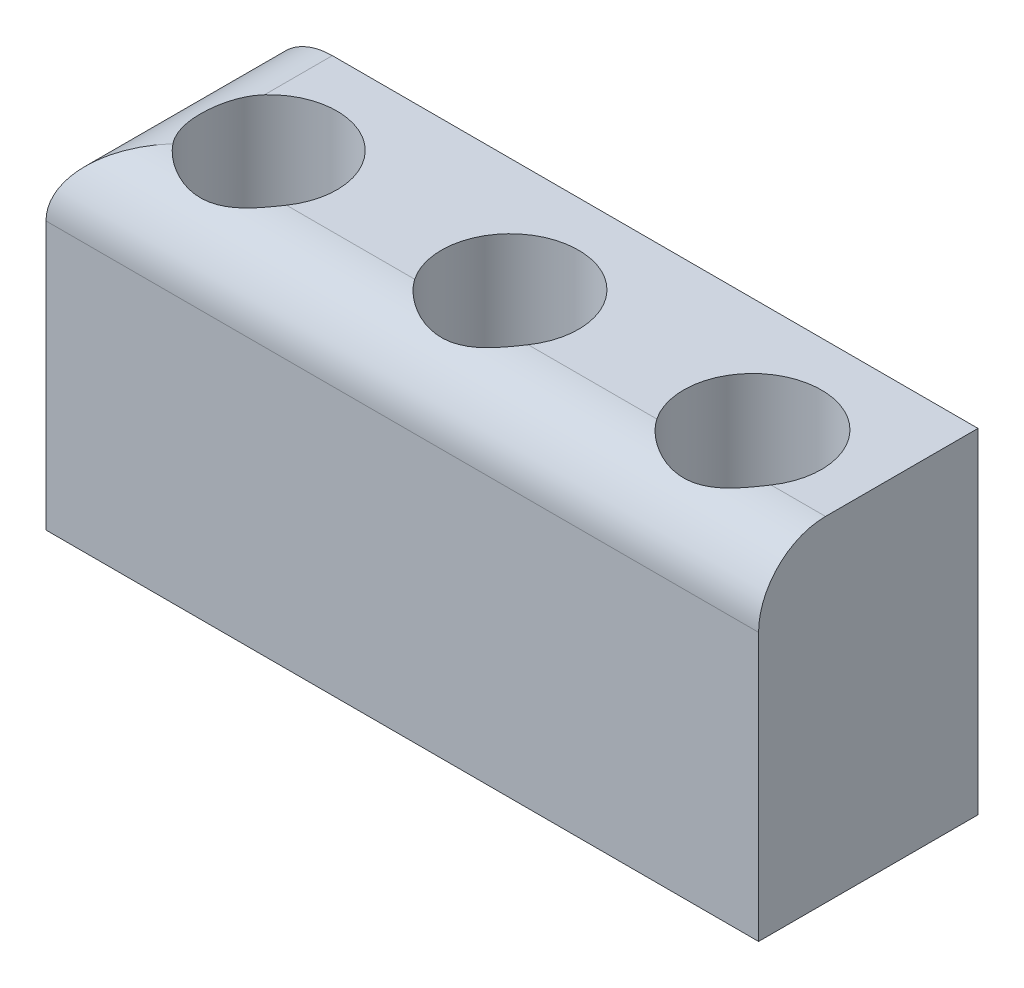
ISO-10303-21;
HEADER;
FILE_DESCRIPTION(('STEP AP214'),'2;1');
FILE_NAME('part.step','',(''),(''),'','','');
FILE_SCHEMA(('AUTOMOTIVE_DESIGN { 1 0 10303 214 1 1 1 1 }'));
ENDSEC;
DATA;
#1=APPLICATION_CONTEXT('core data for automotive mechanical design processes');
#2=APPLICATION_PROTOCOL_DEFINITION('international standard','automotive_design',2000,#1);
#3=PRODUCT_CONTEXT('',#1,'mechanical');
#4=PRODUCT('Part','Part','',(#3));
#5=PRODUCT_RELATED_PRODUCT_CATEGORY('part','',(#4));
#6=PRODUCT_DEFINITION_FORMATION('','',#4);
#7=PRODUCT_DEFINITION_CONTEXT('part definition',#1,'design');
#8=PRODUCT_DEFINITION('design','',#6,#7);
#9=PRODUCT_DEFINITION_SHAPE('','',#8);
#10=(LENGTH_UNIT() NAMED_UNIT(*) SI_UNIT(.MILLI.,.METRE.));
#11=(NAMED_UNIT(*) PLANE_ANGLE_UNIT() SI_UNIT($,.RADIAN.));
#12=(NAMED_UNIT(*) SI_UNIT($,.STERADIAN.) SOLID_ANGLE_UNIT());
#13=UNCERTAINTY_MEASURE_WITH_UNIT(LENGTH_MEASURE(1.E-05),#10,'distance_accuracy_value','');
#14=(GEOMETRIC_REPRESENTATION_CONTEXT(3) GLOBAL_UNCERTAINTY_ASSIGNED_CONTEXT((#13)) GLOBAL_UNIT_ASSIGNED_CONTEXT((#10,
#11,#12)) REPRESENTATION_CONTEXT('',''));
#15=CARTESIAN_POINT('',(0.,0.,0.));
#16=DIRECTION('',(0.,0.,1.));
#17=DIRECTION('',(1.,0.,0.));
#18=AXIS2_PLACEMENT_3D('',#15,#16,#17);
#19=CARTESIAN_POINT('',(0.,10.,0.));
#20=DIRECTION('',(0.,0.,-1.));
#21=DIRECTION('',(-1.,0.,0.));
#22=AXIS2_PLACEMENT_3D('',#19,#20,#21);
#23=PLANE('',#22);
#24=DIRECTION('',(0.,-1.,0.));
#25=VECTOR('',#24,1.);
#26=CARTESIAN_POINT('',(21.2931862765664,10.,0.));
#27=LINE('',#26,#25);
#28=CARTESIAN_POINT('',(21.2931862765664,8.,0.));
#29=VERTEX_POINT('',#28);
#30=CARTESIAN_POINT('',(21.2931862765664,0.,0.));
#31=VERTEX_POINT('',#30);
#32=EDGE_CURVE('E141',#29,#31,#27,.T.);
#33=ORIENTED_EDGE('',*,*,#32,.F.);
#34=DIRECTION('',(1.,0.,0.));
#35=VECTOR('',#34,1.);
#36=CARTESIAN_POINT('',(0.,8.,0.));
#37=LINE('',#36,#35);
#38=CARTESIAN_POINT('',(0.,8.,0.));
#39=VERTEX_POINT('',#38);
#40=EDGE_CURVE('E337',#29,#39,#37,.F.);
#41=ORIENTED_EDGE('',*,*,#40,.T.);
#42=DIRECTION('',(0.,-1.,0.));
#43=VECTOR('',#42,1.);
#44=CARTESIAN_POINT('',(0.,10.,0.));
#45=LINE('',#44,#43);
#46=CARTESIAN_POINT('',(0.,0.,0.));
#47=VERTEX_POINT('',#46);
#48=EDGE_CURVE('E122',#39,#47,#45,.T.);
#49=ORIENTED_EDGE('',*,*,#48,.T.);
#50=DIRECTION('',(1.,0.,0.));
#51=VECTOR('',#50,1.);
#52=CARTESIAN_POINT('',(0.,0.,0.));
#53=LINE('',#52,#51);
#54=EDGE_CURVE('E323',#47,#31,#53,.T.);
#55=ORIENTED_EDGE('',*,*,#54,.T.);
#56=EDGE_LOOP('',(#33,#41,#49,#55));
#57=FACE_BOUND('',#56,.T.);
#58=ADVANCED_FACE('F41',(#57),#23,.F.);
#59=CARTESIAN_POINT('',(21.2931862765664,10.,0.));
#60=DIRECTION('',(-1.,0.,0.));
#61=DIRECTION('',(0.,0.,1.));
#62=AXIS2_PLACEMENT_3D('',#59,#60,#61);
#63=PLANE('',#62);
#64=DIRECTION('',(0.,0.,-1.));
#65=VECTOR('',#64,1.);
#66=CARTESIAN_POINT('',(21.2931862765664,10.,0.));
#67=LINE('',#66,#65);
#68=CARTESIAN_POINT('',(21.2931862765664,10.,-2.));
#69=VERTEX_POINT('',#68);
#70=CARTESIAN_POINT('',(21.2931862765664,10.,-6.55624890817712));
#71=VERTEX_POINT('',#70);
#72=EDGE_CURVE('E123',#69,#71,#67,.T.);
#73=ORIENTED_EDGE('',*,*,#72,.F.);
#74=CARTESIAN_POINT('',(21.2931862765664,8.,-2.));
#75=DIRECTION('',(-1.,0.,0.));
#76=DIRECTION('',(0.,0.,1.));
#77=AXIS2_PLACEMENT_3D('',#74,#75,#76);
#78=CIRCLE('',#77,2.);
#79=EDGE_CURVE('E341',#69,#29,#78,.F.);
#80=ORIENTED_EDGE('',*,*,#79,.T.);
#81=ORIENTED_EDGE('',*,*,#32,.T.);
#82=DIRECTION('',(0.,0.,-1.));
#83=VECTOR('',#82,1.);
#84=CARTESIAN_POINT('',(21.2931862765664,0.,0.));
#85=LINE('',#84,#83);
#86=CARTESIAN_POINT('',(21.2931862765664,0.,-6.55624890817712));
#87=VERTEX_POINT('',#86);
#88=EDGE_CURVE('E138',#31,#87,#85,.T.);
#89=ORIENTED_EDGE('',*,*,#88,.T.);
#90=DIRECTION('',(0.,-1.,0.));
#91=VECTOR('',#90,1.);
#92=CARTESIAN_POINT('',(21.2931862765664,10.,-6.55624890817712));
#93=LINE('',#92,#91);
#94=EDGE_CURVE('E116',#71,#87,#93,.T.);
#95=ORIENTED_EDGE('',*,*,#94,.F.);
#96=EDGE_LOOP('',(#73,#80,#81,#89,#95));
#97=FACE_BOUND('',#96,.T.);
#98=ADVANCED_FACE('F136',(#97),#63,.F.);
#99=CARTESIAN_POINT('',(0.,10.,-6.55624890817712));
#100=DIRECTION('',(0.,0.,-1.));
#101=DIRECTION('',(-1.,0.,0.));
#102=AXIS2_PLACEMENT_3D('',#99,#100,#101);
#103=PLANE('',#102);
#104=DIRECTION('',(0.,-1.,0.));
#105=VECTOR('',#104,1.);
#106=CARTESIAN_POINT('',(0.,10.,-6.55624890817712));
#107=LINE('',#106,#105);
#108=CARTESIAN_POINT('',(0.,8.,-6.55624890817712));
#109=VERTEX_POINT('',#108);
#110=CARTESIAN_POINT('',(0.,0.,-6.55624890817712));
#111=VERTEX_POINT('',#110);
#112=EDGE_CURVE('E142',#109,#111,#107,.T.);
#113=ORIENTED_EDGE('',*,*,#112,.F.);
#114=CARTESIAN_POINT('',(2.,8.,-6.55624890817712));
#115=DIRECTION('',(0.,0.,-1.));
#116=DIRECTION('',(-1.,0.,0.));
#117=AXIS2_PLACEMENT_3D('',#114,#115,#116);
#118=CIRCLE('',#117,2.);
#119=CARTESIAN_POINT('',(2.,10.,-6.55624890817712));
#120=VERTEX_POINT('',#119);
#121=EDGE_CURVE('E11',#109,#120,#118,.T.);
#122=ORIENTED_EDGE('',*,*,#121,.T.);
#123=DIRECTION('',(1.,0.,0.));
#124=VECTOR('',#123,1.);
#125=CARTESIAN_POINT('',(0.,10.,-6.55624890817712));
#126=LINE('',#125,#124);
#127=EDGE_CURVE('E111',#120,#71,#126,.T.);
#128=ORIENTED_EDGE('',*,*,#127,.T.);
#129=ORIENTED_EDGE('',*,*,#94,.T.);
#130=DIRECTION('',(1.,0.,0.));
#131=VECTOR('',#130,1.);
#132=CARTESIAN_POINT('',(0.,0.,-6.55624890817712));
#133=LINE('',#132,#131);
#134=EDGE_CURVE('E329',#111,#87,#133,.T.);
#135=ORIENTED_EDGE('',*,*,#134,.F.);
#136=EDGE_LOOP('',(#113,#122,#128,#129,#135));
#137=FACE_BOUND('',#136,.T.);
#138=ADVANCED_FACE('F113',(#137),#103,.T.);
#139=CARTESIAN_POINT('',(10.7125456911819,10.,-3.15215181068118));
#140=DIRECTION('',(0.,-1.,0.));
#141=DIRECTION('',(0.,0.,-1.));
#142=AXIS2_PLACEMENT_3D('',#139,#140,#141);
#143=CYLINDRICAL_SURFACE('',#142,2.05);
#144=CARTESIAN_POINT('',(10.7125456911819,10.,-3.15215181068118));
#145=DIRECTION('',(0.,1.,0.));
#146=DIRECTION('',(0.,0.,1.));
#147=AXIS2_PLACEMENT_3D('',#144,#145,#146);
#148=CIRCLE('',#147,2.05);
#149=CARTESIAN_POINT('',(12.4081418120621,10.,-2.));
#150=VERTEX_POINT('',#149);
#151=CARTESIAN_POINT('',(9.01694957030164,10.,-2.));
#152=VERTEX_POINT('',#151);
#153=EDGE_CURVE('E134',#150,#152,#148,.T.);
#154=ORIENTED_EDGE('',*,*,#153,.T.);
#155=CARTESIAN_POINT('',(9.01694957030164,10.,-2.));
#156=CARTESIAN_POINT('',(9.04811516550061,10.0000017409659,-1.95412551525751));
#157=CARTESIAN_POINT('',(9.08112011219997,9.99842181852425,-1.90956707539432));
#158=CARTESIAN_POINT('',(9.15049452015726,9.99265575706904,-1.82341271174332));
#159=CARTESIAN_POINT('',(9.18685992637992,9.98847272512037,-1.78181332190696));
#160=CARTESIAN_POINT('',(9.30028207105843,9.97289585578887,-1.66217142989845));
#161=CARTESIAN_POINT('',(9.38196796385999,9.95846357422247,-1.58884164983283));
#162=CARTESIAN_POINT('',(9.55505906481159,9.92599358200038,-1.4566990536128));
#163=CARTESIAN_POINT('',(9.64642643333023,9.9079696821687,-1.39783250098881));
#164=CARTESIAN_POINT('',(9.8375020040176,9.87245570894824,-1.29511591080512));
#165=CARTESIAN_POINT('',(9.93722116516283,9.8549663793918,-1.25128600047153));
#166=CARTESIAN_POINT('',(10.1506493519562,9.82340055121845,-1.1772083491275));
#167=CARTESIAN_POINT('',(10.2648482049664,9.80966669475506,-1.14818669701453));
#168=CARTESIAN_POINT('',(10.4389474382913,9.79584449522583,-1.1196374604616));
#169=CARTESIAN_POINT('',(10.4974362299492,9.79236687643152,-1.11261816860742));
#170=CARTESIAN_POINT('',(10.6148919150787,9.78788972889715,-1.10363222934585));
#171=CARTESIAN_POINT('',(10.6738587529039,9.78688991577071,-1.10166500209453));
#172=CARTESIAN_POINT('',(10.8398001359856,9.78773491380615,-1.10331725019623));
#173=CARTESIAN_POINT('',(10.9467674658554,9.79255905341332,-1.11279039631568));
#174=CARTESIAN_POINT('',(11.1573432589018,9.80960815253039,-1.1481318671608));
#175=CARTESIAN_POINT('',(11.260948364144,9.82184028461422,-1.17401608256897));
#176=CARTESIAN_POINT('',(11.4618049531749,9.85076414261979,-1.24106219308133));
#177=CARTESIAN_POINT('',(11.5590855121883,9.86743335327071,-1.28214735278207));
#178=CARTESIAN_POINT('',(11.7459865726393,9.90169648998168,-1.37857663601589));
#179=CARTESIAN_POINT('',(11.835612043127,9.91928980402491,-1.43391141474995));
#180=CARTESIAN_POINT('',(12.0147188868153,9.95331176583779,-1.56459000462227));
#181=CARTESIAN_POINT('',(12.1031945219278,9.96942352022737,-1.64142579666401));
#182=CARTESIAN_POINT('',(12.2256551895564,9.98693187083065,-1.76778473953623));
#183=CARTESIAN_POINT('',(12.2648554671586,9.99166167242333,-1.81188510034));
#184=CARTESIAN_POINT('',(12.3394528108292,9.99819866141854,-1.9034843877563));
#185=CARTESIAN_POINT('',(12.37484480588,10.0000019958956,-1.95098770891097));
#186=CARTESIAN_POINT('',(12.4081418120621,10.,-2.));
#187=B_SPLINE_CURVE_WITH_KNOTS('',3,(#155,#156,#157,#158,#159,#160,#161,#162,#163,#164,#165,
#166,#167,#168,#169,#170,#171,#172,#173,#174,#175,#176,#177,#178,#179,#180,#181,#182,#183,#184,
#185,#186),.UNSPECIFIED.,.F.,.F.,(4,2,2,2,2,2,2,2,2,2,2,2,2,2,2,4),(0.,0.166218724754862,
0.332239430796913,0.66269233706878,0.991898258682401,1.32154313355269,1.67526892557877,
1.85206622728029,2.02884323640177,2.34956938109803,2.67060655715533,2.99004474862322,
3.30927398591472,3.66206412979007,3.83938792292995,4.01694498801978),.UNSPECIFIED.);
#188=EDGE_CURVE('E162',#152,#150,#187,.T.);
#189=ORIENTED_EDGE('',*,*,#188,.T.);
#190=EDGE_LOOP('',(#154,#189));
#191=FACE_BOUND('',#190,.T.);
#192=CARTESIAN_POINT('',(10.7125456911819,0.,-3.15215181068118));
#193=DIRECTION('',(0.,1.,0.));
#194=DIRECTION('',(0.,0.,1.));
#195=AXIS2_PLACEMENT_3D('',#192,#193,#194);
#196=CIRCLE('',#195,2.05);
#197=CARTESIAN_POINT('',(10.7125456911819,0.,-1.10215181068118));
#198=VERTEX_POINT('',#197);
#199=EDGE_CURVE('E319',#198,#198,#196,.T.);
#200=ORIENTED_EDGE('',*,*,#199,.F.);
#201=EDGE_LOOP('',(#200));
#202=FACE_BOUND('',#201,.T.);
#203=ADVANCED_FACE('F177',(#191,#202),#143,.F.);
#204=CARTESIAN_POINT('',(3.50247739127908,10.,-3.15215181068118));
#205=DIRECTION('',(0.,-1.,0.));
#206=DIRECTION('',(0.,0.,-1.));
#207=AXIS2_PLACEMENT_3D('',#204,#205,#206);
#208=CYLINDRICAL_SURFACE('',#207,2.04);
#209=CARTESIAN_POINT('',(2.,10.,-4.53206546330414));
#210=CARTESIAN_POINT('',(1.96152282678187,9.9999968813164,-4.49017276144605));
#211=CARTESIAN_POINT('',(1.92483190303057,9.9988903583751,-4.44670248400531));
#212=CARTESIAN_POINT('',(1.85525093852736,9.9950596218343,-4.3569212378015));
#213=CARTESIAN_POINT('',(1.8223588141054,9.9923363001434,-4.31061184785865));
#214=CARTESIAN_POINT('',(1.7297049349696,9.9826260223704,-4.16789019112435));
#215=CARTESIAN_POINT('',(1.67591170612522,9.97409711626893,-4.06762549476744));
#216=CARTESIAN_POINT('',(1.58575448050229,9.95717025706446,-3.85969706323972));
#217=CARTESIAN_POINT('',(1.5493763400317,9.94877220307134,-3.75203941380689));
#218=CARTESIAN_POINT('',(1.49496746917773,9.93539067008869,-3.53204008034623));
#219=CARTESIAN_POINT('',(1.47691939552641,9.93040396486169,-3.41970292888682));
#220=CARTESIAN_POINT('',(1.45973713631012,9.92566925519223,-3.19338759381071));
#221=CARTESIAN_POINT('',(1.46061687116165,9.92592510637013,-3.07940826402465));
#222=CARTESIAN_POINT('',(1.48130321971913,9.93159571571192,-2.85321120935946));
#223=CARTESIAN_POINT('',(1.50112833595601,9.93701551710276,-2.74099531560322));
#224=CARTESIAN_POINT('',(1.55847287105539,9.95086964404149,-2.52379431121379));
#225=CARTESIAN_POINT('',(1.59563753057686,9.95924274432075,-2.41871053476813));
#226=CARTESIAN_POINT('',(1.68650624771414,9.97581538357308,-2.21613856881463));
#227=CARTESIAN_POINT('',(1.74017551717264,9.98401524919998,-2.11863493848165));
#228=CARTESIAN_POINT('',(1.83103072746683,9.99306721348111,-1.98135354310488));
#229=CARTESIAN_POINT('',(1.86241595879251,9.99552702713277,-1.93776818496805));
#230=CARTESIAN_POINT('',(1.8954912889424,9.99726761584748,-1.8954912889424));
#231=B_SPLINE_CURVE_WITH_KNOTS('',3,(#209,#210,#211,#212,#213,#214,#215,#216,#217,#218,#219,
#220,#221,#222,#223,#224,#225,#226,#227,#228,#229,#230),.UNSPECIFIED.,.F.,.F.,(4,2,2,2,2,2,2,2,
2,2,4),(0.,0.170503303976342,0.340912636922252,0.681494695044775,1.02179967765991,
1.36178237479678,1.70201512002638,2.04258048496618,2.37646459247655,2.70964971272202,
2.87077143140057),.UNSPECIFIED.);
#232=CARTESIAN_POINT('',(2.,10.,-4.53206546330414));
#233=VERTEX_POINT('',#232);
#234=CARTESIAN_POINT('',(1.8954912889424,9.99726761584748,-1.8954912889424));
#235=VERTEX_POINT('',#234);
#236=EDGE_CURVE('E66',#233,#235,#231,.T.);
#237=ORIENTED_EDGE('',*,*,#236,.T.);
#238=CARTESIAN_POINT('',(1.8954912889424,9.99726761584748,-1.8954912889424));
#239=CARTESIAN_POINT('',(1.9303328292988,9.9949362790777,-1.85093372265649));
#240=CARTESIAN_POINT('',(1.96696118614232,9.99119035534617,-1.80791729959754));
#241=CARTESIAN_POINT('',(2.04348030626066,9.98147266296752,-1.72523310354955));
#242=CARTESIAN_POINT('',(2.0833679204952,9.9755030234429,-1.6855621717963));
#243=CARTESIAN_POINT('',(2.2073908731636,9.95517776261309,-1.57199683223511));
#244=CARTESIAN_POINT('',(2.29602989506303,9.938391472129,-1.50336736697636));
#245=CARTESIAN_POINT('',(2.48270254818285,9.9031186382051,-1.38182321053908));
#246=CARTESIAN_POINT('',(2.58070971339243,9.88463689024258,-1.32886588404647));
#247=CARTESIAN_POINT('',(2.78455020902168,9.85036047701517,-1.23942371659152));
#248=CARTESIAN_POINT('',(2.89038379241026,9.83456589866067,-1.20293940834833));
#249=CARTESIAN_POINT('',(3.05474048838589,9.8155994969719,-1.16105167688425));
#250=CARTESIAN_POINT('',(3.11139826692209,9.81001685714625,-1.1491495876532));
#251=CARTESIAN_POINT('',(3.22567746593983,9.80098395220364,-1.13018973824175));
#252=CARTESIAN_POINT('',(3.28329843219951,9.79753270955836,-1.12312975714801));
#253=CARTESIAN_POINT('',(3.39898979792275,9.79302747974986,-1.11395290905562));
#254=CARTESIAN_POINT('',(3.45705987432083,9.79197190580231,-1.1118327701006));
#255=CARTESIAN_POINT('',(3.57314450079541,9.79232437686163,-1.11254898223543));
#256=CARTESIAN_POINT('',(3.63115905481972,9.79373223129868,-1.1153849499229));
#257=CARTESIAN_POINT('',(3.79279210665773,9.80101059975006,-1.13022870434017));
#258=CARTESIAN_POINT('',(3.89583986083324,9.80954667419995,-1.1477515035603));
#259=CARTESIAN_POINT('',(4.09747636534391,9.83239095820901,-1.19807491801104));
#260=CARTESIAN_POINT('',(4.19605984298853,9.84670580491441,-1.23089310731556));
#261=CARTESIAN_POINT('',(4.39101319420934,9.8787116682733,-1.31264955333048));
#262=CARTESIAN_POINT('',(4.48708805729437,9.89652482294332,-1.36224170663226));
#263=CARTESIAN_POINT('',(4.67024173163415,9.93104428796556,-1.4759860568529));
#264=CARTESIAN_POINT('',(4.7573337973505,9.9477522156681,-1.54011634172911));
#265=CARTESIAN_POINT('',(4.90444841241208,9.97304880179615,-1.66771454319505));
#266=CARTESIAN_POINT('',(4.96640431991322,9.98259241147199,-1.7287598519291));
#267=CARTESIAN_POINT('',(5.08244293133497,9.99607936798475,-1.85872229846082));
#268=CARTESIAN_POINT('',(5.13650527767468,10.0000084562277,-1.9276589998553));
#269=CARTESIAN_POINT('',(5.18596965593136,10.,-2.));
#270=B_SPLINE_CURVE_WITH_KNOTS('',3,(#238,#239,#240,#241,#242,#243,#244,#245,#246,#247,#248,
#249,#250,#251,#252,#253,#254,#255,#256,#257,#258,#259,#260,#261,#262,#263,#264,#265,#266,#267,
#268,#269),.UNSPECIFIED.,.F.,.F.,(4,2,2,2,2,2,2,2,2,2,2,2,2,2,2,4),(0.,0.169672227725612,
0.339182416632322,0.677514634480656,1.01491779104335,1.352331858069,1.52661240576198,
1.7008129632322,1.87489810429029,2.04896977878929,2.36202022833764,2.67543125621349,
3.00282569517661,3.32972992403501,3.59138595966477,3.85370532105994),.UNSPECIFIED.);
#271=CARTESIAN_POINT('',(5.18596965593136,10.,-2.));
#272=VERTEX_POINT('',#271);
#273=EDGE_CURVE('E190',#235,#272,#270,.T.);
#274=ORIENTED_EDGE('',*,*,#273,.T.);
#275=CARTESIAN_POINT('',(3.50247739127908,10.,-3.15215181068118));
#276=DIRECTION('',(0.,1.,0.));
#277=DIRECTION('',(0.,0.,1.));
#278=AXIS2_PLACEMENT_3D('',#275,#276,#277);
#279=CIRCLE('',#278,2.04);
#280=EDGE_CURVE('E297',#272,#233,#279,.T.);
#281=ORIENTED_EDGE('',*,*,#280,.T.);
#282=EDGE_LOOP('',(#237,#274,#281));
#283=FACE_BOUND('',#282,.T.);
#284=CARTESIAN_POINT('',(3.50247739127908,0.,-3.15215181068118));
#285=DIRECTION('',(0.,1.,0.));
#286=DIRECTION('',(0.,0.,1.));
#287=AXIS2_PLACEMENT_3D('',#284,#285,#286);
#288=CIRCLE('',#287,2.04);
#289=CARTESIAN_POINT('',(3.50247739127908,0.,-1.11215181068118));
#290=VERTEX_POINT('',#289);
#291=EDGE_CURVE('E315',#290,#290,#288,.T.);
#292=ORIENTED_EDGE('',*,*,#291,.F.);
#293=EDGE_LOOP('',(#292));
#294=FACE_BOUND('',#293,.T.);
#295=ADVANCED_FACE('F203',(#283,#294),#208,.F.);
#296=CARTESIAN_POINT('',(17.959518774191,10.,-3.15215181068118));
#297=DIRECTION('',(0.,-1.,0.));
#298=DIRECTION('',(0.,0.,-1.));
#299=AXIS2_PLACEMENT_3D('',#296,#297,#298);
#300=CYLINDRICAL_SURFACE('',#299,2.06);
#301=CARTESIAN_POINT('',(17.959518774191,10.,-3.15215181068118));
#302=DIRECTION('',(0.,1.,0.));
#303=DIRECTION('',(0.,0.,1.));
#304=AXIS2_PLACEMENT_3D('',#301,#302,#303);
#305=CIRCLE('',#304,2.06);
#306=CARTESIAN_POINT('',(19.6671915195214,10.,-2.));
#307=VERTEX_POINT('',#306);
#308=CARTESIAN_POINT('',(16.2518460288607,10.,-2.));
#309=VERTEX_POINT('',#308);
#310=EDGE_CURVE('E301',#307,#309,#305,.T.);
#311=ORIENTED_EDGE('',*,*,#310,.T.);
#312=CARTESIAN_POINT('',(16.2518460288607,10.,-2.));
#313=CARTESIAN_POINT('',(16.2829608098985,10.0000018000319,-1.95387392350544));
#314=CARTESIAN_POINT('',(16.315922217756,9.99840446007961,-1.90906031059728));
#315=CARTESIAN_POINT('',(16.385222658968,9.99257058927457,-1.822391436373));
#316=CARTESIAN_POINT('',(16.4215575682341,9.98833724569766,-1.78053267021127));
#317=CARTESIAN_POINT('',(16.5348963145522,9.97256503578855,-1.66012194000278));
#318=CARTESIAN_POINT('',(16.6165460657682,9.95794295622894,-1.58627610245584));
#319=CARTESIAN_POINT('',(16.7896027587647,9.9249928319763,-1.45309409756908));
#320=CARTESIAN_POINT('',(16.8809709734589,9.90667925420749,-1.39370322748438));
#321=CARTESIAN_POINT('',(17.0721095795759,9.87050497407901,-1.2899080394282));
#322=CARTESIAN_POINT('',(17.1718916538183,9.85264494776082,-1.24552500294539));
#323=CARTESIAN_POINT('',(17.3858363219219,9.82022631907824,-1.17016723170775));
#324=CARTESIAN_POINT('',(17.5005155550167,9.80602131315223,-1.1404663053393));
#325=CARTESIAN_POINT('',(17.6754422648345,9.79157355132835,-1.11097347587163));
#326=CARTESIAN_POINT('',(17.7342230304083,9.78790097401479,-1.10365224993708));
#327=CARTESIAN_POINT('',(17.8522960635662,9.7830755743939,-1.09409180439775));
#328=CARTESIAN_POINT('',(17.9115882693028,9.78192245158607,-1.09185197872273));
#329=CARTESIAN_POINT('',(18.0783505900023,9.78241245598488,-1.09278339295591));
#330=CARTESIAN_POINT('',(18.1858455946593,9.78708659928196,-1.10182553699009));
#331=CARTESIAN_POINT('',(18.397532674722,9.80403084305276,-1.13639256227107));
#332=CARTESIAN_POINT('',(18.5017214453115,9.81630830684584,-1.16193342248133));
#333=CARTESIAN_POINT('',(18.7034400863894,9.84545518869487,-1.22825654878182));
#334=CARTESIAN_POINT('',(18.8010165983401,9.86228704857269,-1.26891512878083));
#335=CARTESIAN_POINT('',(18.9886387742966,9.89703904632176,-1.364531785091));
#336=CARTESIAN_POINT('',(19.0786888858454,9.91495853052442,-1.41948133642191));
#337=CARTESIAN_POINT('',(19.2128026445937,9.94093127972613,-1.51615601735436));
#338=CARTESIAN_POINT('',(19.2599768446205,9.94991135094069,-1.55339302871463));
#339=CARTESIAN_POINT('',(19.3510496890833,9.96626249196988,-1.63200127945231));
#340=CARTESIAN_POINT('',(19.394949179647,9.97363397836912,-1.67337144438715));
#341=CARTESIAN_POINT('',(19.4793081529846,9.98605844420893,-1.76020473210447));
#342=CARTESIAN_POINT('',(19.5197504646651,9.99110034318282,-1.80568620994795));
#343=CARTESIAN_POINT('',(19.5966119649698,9.998075820091,-1.90024991384327));
#344=CARTESIAN_POINT('',(19.6330254263021,10.0000050246782,-1.94933710494176));
#345=CARTESIAN_POINT('',(19.6671915195214,10.,-2.));
#346=B_SPLINE_CURVE_WITH_KNOTS('',3,(#312,#313,#314,#315,#316,#317,#318,#319,#320,#321,#322,
#323,#324,#325,#326,#327,#328,#329,#330,#331,#332,#333,#334,#335,#336,#337,#338,#339,#340,#341,
#342,#343,#344,#345),.UNSPECIFIED.,.F.,.F.,(4,2,2,2,2,2,2,2,2,2,2,2,2,2,2,2,4),(0.,
0.166757252946238,0.333313264882192,0.664783582452773,0.994979282491595,1.32564126389427,
1.68140764639647,1.85921539486416,2.03700193467963,2.3591571031078,2.68162474671193,
3.00151017189132,3.32120521205177,3.50329575905127,3.68533909288479,3.86823960451499,
4.0513968689653),.UNSPECIFIED.);
#347=EDGE_CURVE('E170',#309,#307,#346,.T.);
#348=ORIENTED_EDGE('',*,*,#347,.T.);
#349=EDGE_LOOP('',(#311,#348));
#350=FACE_BOUND('',#349,.T.);
#351=CARTESIAN_POINT('',(17.959518774191,0.,-3.15215181068118));
#352=DIRECTION('',(0.,1.,0.));
#353=DIRECTION('',(0.,0.,1.));
#354=AXIS2_PLACEMENT_3D('',#351,#352,#353);
#355=CIRCLE('',#354,2.06);
#356=CARTESIAN_POINT('',(17.959518774191,0.,-1.09215181068118));
#357=VERTEX_POINT('',#356);
#358=EDGE_CURVE('E311',#357,#357,#355,.T.);
#359=ORIENTED_EDGE('',*,*,#358,.F.);
#360=EDGE_LOOP('',(#359));
#361=FACE_BOUND('',#360,.T.);
#362=ADVANCED_FACE('F185',(#350,#361),#300,.F.);
#363=CARTESIAN_POINT('',(0.,10.,0.));
#364=DIRECTION('',(-1.,0.,0.));
#365=DIRECTION('',(0.,0.,1.));
#366=AXIS2_PLACEMENT_3D('',#363,#364,#365);
#367=PLANE('',#366);
#368=ORIENTED_EDGE('',*,*,#48,.F.);
#369=DIRECTION('',(0.,0.,-1.));
#370=VECTOR('',#369,1.);
#371=CARTESIAN_POINT('',(0.,8.,0.));
#372=LINE('',#371,#370);
#373=EDGE_CURVE('E52',#39,#109,#372,.T.);
#374=ORIENTED_EDGE('',*,*,#373,.T.);
#375=ORIENTED_EDGE('',*,*,#112,.T.);
#376=DIRECTION('',(0.,0.,-1.));
#377=VECTOR('',#376,1.);
#378=CARTESIAN_POINT('',(0.,0.,0.));
#379=LINE('',#378,#377);
#380=EDGE_CURVE('E308',#47,#111,#379,.T.);
#381=ORIENTED_EDGE('',*,*,#380,.F.);
#382=EDGE_LOOP('',(#368,#374,#375,#381));
#383=FACE_BOUND('',#382,.T.);
#384=ADVANCED_FACE('F211',(#383),#367,.T.);
#385=CARTESIAN_POINT('',(0.,10.,0.));
#386=DIRECTION('',(0.,1.,0.));
#387=DIRECTION('',(0.,0.,1.));
#388=AXIS2_PLACEMENT_3D('',#385,#386,#387);
#389=PLANE('',#388);
#390=ORIENTED_EDGE('',*,*,#280,.F.);
#391=DIRECTION('',(1.,0.,0.));
#392=VECTOR('',#391,1.);
#393=CARTESIAN_POINT('',(21.2931862765664,10.,-2.));
#394=LINE('',#393,#392);
#395=EDGE_CURVE('E158',#272,#152,#394,.T.);
#396=ORIENTED_EDGE('',*,*,#395,.T.);
#397=ORIENTED_EDGE('',*,*,#153,.F.);
#398=DIRECTION('',(1.,0.,0.));
#399=VECTOR('',#398,1.);
#400=CARTESIAN_POINT('',(21.2931862765664,10.,-2.));
#401=LINE('',#400,#399);
#402=EDGE_CURVE('E155',#150,#309,#401,.T.);
#403=ORIENTED_EDGE('',*,*,#402,.T.);
#404=ORIENTED_EDGE('',*,*,#310,.F.);
#405=DIRECTION('',(1.,0.,0.));
#406=VECTOR('',#405,1.);
#407=CARTESIAN_POINT('',(21.2931862765664,10.,-2.));
#408=LINE('',#407,#406);
#409=EDGE_CURVE('E130',#307,#69,#408,.T.);
#410=ORIENTED_EDGE('',*,*,#409,.T.);
#411=ORIENTED_EDGE('',*,*,#72,.T.);
#412=ORIENTED_EDGE('',*,*,#127,.F.);
#413=DIRECTION('',(0.,0.,-1.));
#414=VECTOR('',#413,1.);
#415=CARTESIAN_POINT('',(2.,10.,0.));
#416=LINE('',#415,#414);
#417=EDGE_CURVE('E146',#120,#233,#416,.F.);
#418=ORIENTED_EDGE('',*,*,#417,.T.);
#419=EDGE_LOOP('',(#390,#396,#397,#403,#404,#410,#411,#412,#418));
#420=FACE_BOUND('',#419,.T.);
#421=ADVANCED_FACE('F127',(#420),#389,.T.);
#422=CARTESIAN_POINT('',(0.,0.,0.));
#423=DIRECTION('',(0.,1.,0.));
#424=DIRECTION('',(0.,0.,1.));
#425=AXIS2_PLACEMENT_3D('',#422,#423,#424);
#426=PLANE('',#425);
#427=ORIENTED_EDGE('',*,*,#358,.T.);
#428=EDGE_LOOP('',(#427));
#429=FACE_BOUND('',#428,.T.);
#430=ORIENTED_EDGE('',*,*,#291,.T.);
#431=EDGE_LOOP('',(#430));
#432=FACE_BOUND('',#431,.T.);
#433=ORIENTED_EDGE('',*,*,#199,.T.);
#434=EDGE_LOOP('',(#433));
#435=FACE_BOUND('',#434,.T.);
#436=ORIENTED_EDGE('',*,*,#54,.F.);
#437=ORIENTED_EDGE('',*,*,#380,.T.);
#438=ORIENTED_EDGE('',*,*,#134,.T.);
#439=ORIENTED_EDGE('',*,*,#88,.F.);
#440=EDGE_LOOP('',(#436,#437,#438,#439));
#441=FACE_BOUND('',#440,.T.);
#442=ADVANCED_FACE('F227',(#429,#432,#435,#441),#426,.F.);
#443=CARTESIAN_POINT('',(2.,8.,0.));
#444=DIRECTION('',(0.,0.,-1.));
#445=DIRECTION('',(-1.,0.,0.));
#446=AXIS2_PLACEMENT_3D('',#443,#444,#445);
#447=CYLINDRICAL_SURFACE('',#446,2.);
#448=ORIENTED_EDGE('',*,*,#121,.F.);
#449=ORIENTED_EDGE('',*,*,#373,.F.);
#450=CARTESIAN_POINT('',(2.,8.,-2.));
#451=DIRECTION('',(-0.707106781186547,0.,-0.707106781186547));
#452=DIRECTION('',(0.707106781186547,0.,-0.707106781186547));
#453=AXIS2_PLACEMENT_3D('',#450,#451,#452);
#454=ELLIPSE('',#453,2.82842712474619,2.);
#455=EDGE_CURVE('E46',#235,#39,#454,.F.);
#456=ORIENTED_EDGE('',*,*,#455,.F.);
#457=ORIENTED_EDGE('',*,*,#236,.F.);
#458=ORIENTED_EDGE('',*,*,#417,.F.);
#459=EDGE_LOOP('',(#448,#449,#456,#457,#458));
#460=FACE_BOUND('',#459,.T.);
#461=ADVANCED_FACE('F43',(#460),#447,.T.);
#462=CARTESIAN_POINT('',(0.,8.,-2.));
#463=DIRECTION('',(-1.,0.,0.));
#464=DIRECTION('',(0.,0.,1.));
#465=AXIS2_PLACEMENT_3D('',#462,#463,#464);
#466=CYLINDRICAL_SURFACE('',#465,2.);
#467=ORIENTED_EDGE('',*,*,#455,.T.);
#468=ORIENTED_EDGE('',*,*,#40,.F.);
#469=ORIENTED_EDGE('',*,*,#79,.F.);
#470=ORIENTED_EDGE('',*,*,#409,.F.);
#471=ORIENTED_EDGE('',*,*,#347,.F.);
#472=ORIENTED_EDGE('',*,*,#402,.F.);
#473=ORIENTED_EDGE('',*,*,#188,.F.);
#474=ORIENTED_EDGE('',*,*,#395,.F.);
#475=ORIENTED_EDGE('',*,*,#273,.F.);
#476=EDGE_LOOP('',(#467,#468,#469,#470,#471,#472,#473,#474,#475));
#477=FACE_BOUND('',#476,.T.);
#478=ADVANCED_FACE('F181',(#477),#466,.T.);
#479=CLOSED_SHELL('',(#58,#98,#138,#203,#295,#362,#384,#421,#442,#461,#478));
#480=MANIFOLD_SOLID_BREP('B2',#479);
#481=ADVANCED_BREP_SHAPE_REPRESENTATION('',(#18,#480),#14);
#482=SHAPE_DEFINITION_REPRESENTATION(#9,#481);
ENDSEC;
END-ISO-10303-21;
